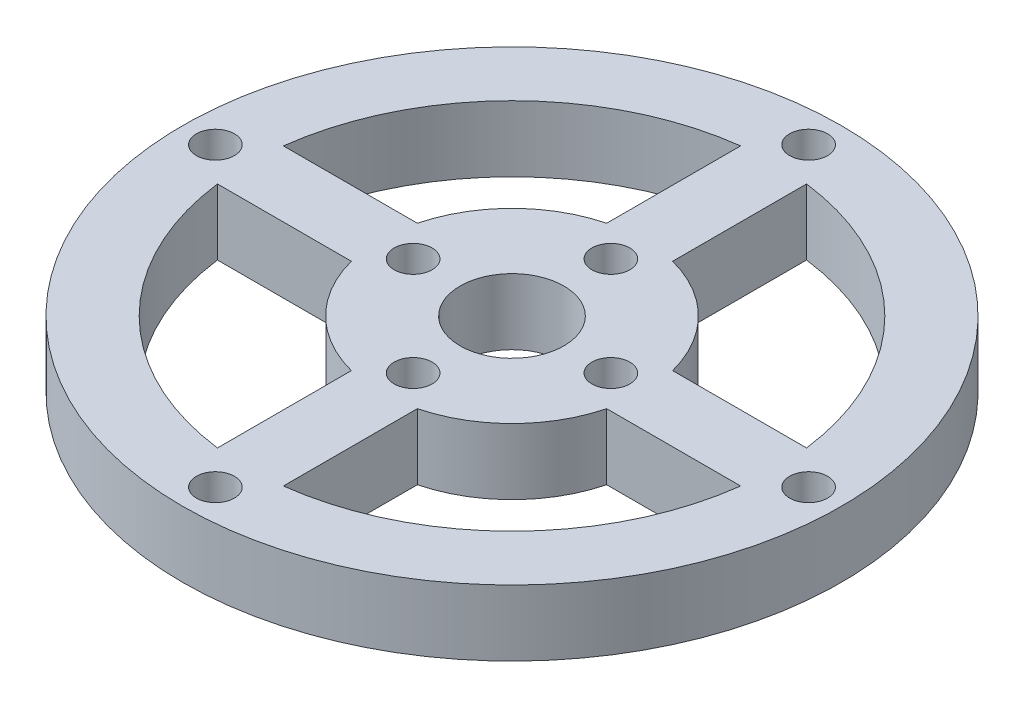
ISO-10303-21;
HEADER;
FILE_DESCRIPTION(('STEP AP214'),'2;1');
FILE_NAME('part.step','',(''),(''),'','','');
FILE_SCHEMA(('AUTOMOTIVE_DESIGN { 1 0 10303 214 1 1 1 1 }'));
ENDSEC;
DATA;
#1=APPLICATION_CONTEXT('core data for automotive mechanical design processes');
#2=APPLICATION_PROTOCOL_DEFINITION('international standard','automotive_design',2000,#1);
#3=PRODUCT_CONTEXT('',#1,'mechanical');
#4=PRODUCT('Part','Part','',(#3));
#5=PRODUCT_RELATED_PRODUCT_CATEGORY('part','',(#4));
#6=PRODUCT_DEFINITION_FORMATION('','',#4);
#7=PRODUCT_DEFINITION_CONTEXT('part definition',#1,'design');
#8=PRODUCT_DEFINITION('design','',#6,#7);
#9=PRODUCT_DEFINITION_SHAPE('','',#8);
#10=(LENGTH_UNIT() NAMED_UNIT(*) SI_UNIT(.MILLI.,.METRE.));
#11=(NAMED_UNIT(*) PLANE_ANGLE_UNIT() SI_UNIT($,.RADIAN.));
#12=(NAMED_UNIT(*) SI_UNIT($,.STERADIAN.) SOLID_ANGLE_UNIT());
#13=UNCERTAINTY_MEASURE_WITH_UNIT(LENGTH_MEASURE(1.E-05),#10,'distance_accuracy_value','');
#14=(GEOMETRIC_REPRESENTATION_CONTEXT(3) GLOBAL_UNCERTAINTY_ASSIGNED_CONTEXT((#13)) GLOBAL_UNIT_ASSIGNED_CONTEXT((#10,
#11,#12)) REPRESENTATION_CONTEXT('',''));
#15=CARTESIAN_POINT('',(0.,0.,0.));
#16=DIRECTION('',(0.,0.,1.));
#17=DIRECTION('',(1.,0.,0.));
#18=AXIS2_PLACEMENT_3D('',#15,#16,#17);
#19=CARTESIAN_POINT('',(0.,6.35,0.));
#20=DIRECTION('',(0.,-1.,0.));
#21=DIRECTION('',(0.,0.,-1.));
#22=AXIS2_PLACEMENT_3D('',#19,#20,#21);
#23=CYLINDRICAL_SURFACE('',#22,25.4);
#24=CARTESIAN_POINT('',(0.,0.,0.));
#25=DIRECTION('',(0.,1.,0.));
#26=DIRECTION('',(0.,0.,1.));
#27=AXIS2_PLACEMENT_3D('',#24,#25,#26);
#28=CIRCLE('',#27,25.4);
#29=CARTESIAN_POINT('',(3.175,0.,25.2007812378902));
#30=VERTEX_POINT('',#29);
#31=CARTESIAN_POINT('',(25.2007812378902,0.,3.17499999999996));
#32=VERTEX_POINT('',#31);
#33=EDGE_CURVE('E300',#30,#32,#28,.T.);
#34=ORIENTED_EDGE('',*,*,#33,.F.);
#35=DIRECTION('',(0.,-1.,0.));
#36=VECTOR('',#35,1.);
#37=CARTESIAN_POINT('',(3.175,6.35,25.2007812378902));
#38=LINE('',#37,#36);
#39=CARTESIAN_POINT('',(3.175,6.35,25.2007812378902));
#40=VERTEX_POINT('',#39);
#41=EDGE_CURVE('E11',#40,#30,#38,.T.);
#42=ORIENTED_EDGE('',*,*,#41,.F.);
#43=CARTESIAN_POINT('',(0.,6.35,0.));
#44=DIRECTION('',(0.,1.,0.));
#45=DIRECTION('',(0.,0.,1.));
#46=AXIS2_PLACEMENT_3D('',#43,#44,#45);
#47=CIRCLE('',#46,25.4);
#48=CARTESIAN_POINT('',(25.2007812378902,6.35,3.17499999999996));
#49=VERTEX_POINT('',#48);
#50=EDGE_CURVE('E175',#40,#49,#47,.T.);
#51=ORIENTED_EDGE('',*,*,#50,.T.);
#52=DIRECTION('',(0.,-1.,0.));
#53=VECTOR('',#52,1.);
#54=CARTESIAN_POINT('',(25.2007812378902,6.35,3.17499999999996));
#55=LINE('',#54,#53);
#56=EDGE_CURVE('E58',#49,#32,#55,.T.);
#57=ORIENTED_EDGE('',*,*,#56,.T.);
#58=EDGE_LOOP('',(#34,#42,#51,#57));
#59=FACE_BOUND('',#58,.T.);
#60=ADVANCED_FACE('F39',(#59),#23,.F.);
#61=CARTESIAN_POINT('',(3.17499999999997,6.35,0.));
#62=DIRECTION('',(-1.,0.,0.));
#63=DIRECTION('',(0.,0.,1.));
#64=AXIS2_PLACEMENT_3D('',#61,#62,#63);
#65=PLANE('',#64);
#66=DIRECTION('',(0.,0.,-1.));
#67=VECTOR('',#66,1.);
#68=CARTESIAN_POINT('',(3.17499999999997,0.,0.));
#69=LINE('',#68,#67);
#70=CARTESIAN_POINT('',(3.17499999999998,0.,12.2967221242086));
#71=VERTEX_POINT('',#70);
#72=EDGE_CURVE('E180',#30,#71,#69,.T.);
#73=ORIENTED_EDGE('',*,*,#72,.T.);
#74=DIRECTION('',(0.,-1.,0.));
#75=VECTOR('',#74,1.);
#76=CARTESIAN_POINT('',(3.17499999999998,6.35,12.2967221242086));
#77=LINE('',#76,#75);
#78=CARTESIAN_POINT('',(3.17499999999998,6.35,12.2967221242086));
#79=VERTEX_POINT('',#78);
#80=EDGE_CURVE('E49',#79,#71,#77,.T.);
#81=ORIENTED_EDGE('',*,*,#80,.F.);
#82=DIRECTION('',(0.,0.,-1.));
#83=VECTOR('',#82,1.);
#84=CARTESIAN_POINT('',(3.17499999999997,6.35,0.));
#85=LINE('',#84,#83);
#86=EDGE_CURVE('E168',#40,#79,#85,.T.);
#87=ORIENTED_EDGE('',*,*,#86,.F.);
#88=ORIENTED_EDGE('',*,*,#41,.T.);
#89=EDGE_LOOP('',(#73,#81,#87,#88));
#90=FACE_BOUND('',#89,.T.);
#91=ADVANCED_FACE('F178',(#90),#65,.F.);
#92=CARTESIAN_POINT('',(0.,6.35,0.));
#93=DIRECTION('',(0.,-1.,0.));
#94=DIRECTION('',(0.,0.,-1.));
#95=AXIS2_PLACEMENT_3D('',#92,#93,#94);
#96=CYLINDRICAL_SURFACE('',#95,12.7);
#97=CARTESIAN_POINT('',(0.,0.,0.));
#98=DIRECTION('',(0.,1.,0.));
#99=DIRECTION('',(0.,0.,1.));
#100=AXIS2_PLACEMENT_3D('',#97,#98,#99);
#101=CIRCLE('',#100,12.7);
#102=CARTESIAN_POINT('',(12.2967221242086,0.,3.17499999999997));
#103=VERTEX_POINT('',#102);
#104=EDGE_CURVE('E292',#71,#103,#101,.T.);
#105=ORIENTED_EDGE('',*,*,#104,.T.);
#106=DIRECTION('',(0.,-1.,0.));
#107=VECTOR('',#106,1.);
#108=CARTESIAN_POINT('',(12.2967221242086,6.35,3.17499999999997));
#109=LINE('',#108,#107);
#110=CARTESIAN_POINT('',(12.2967221242086,6.35,3.17499999999997));
#111=VERTEX_POINT('',#110);
#112=EDGE_CURVE('E108',#111,#103,#109,.T.);
#113=ORIENTED_EDGE('',*,*,#112,.F.);
#114=CARTESIAN_POINT('',(0.,6.35,0.));
#115=DIRECTION('',(0.,1.,0.));
#116=DIRECTION('',(0.,0.,1.));
#117=AXIS2_PLACEMENT_3D('',#114,#115,#116);
#118=CIRCLE('',#117,12.7);
#119=EDGE_CURVE('E160',#79,#111,#118,.T.);
#120=ORIENTED_EDGE('',*,*,#119,.F.);
#121=ORIENTED_EDGE('',*,*,#80,.T.);
#122=EDGE_LOOP('',(#105,#113,#120,#121));
#123=FACE_BOUND('',#122,.T.);
#124=ADVANCED_FACE('F162',(#123),#96,.T.);
#125=CARTESIAN_POINT('',(0.,6.35,-3.17499999999996));
#126=DIRECTION('',(0.,0.,1.));
#127=DIRECTION('',(1.,0.,0.));
#128=AXIS2_PLACEMENT_3D('',#125,#126,#127);
#129=PLANE('',#128);
#130=DIRECTION('',(-1.,0.,0.));
#131=VECTOR('',#130,1.);
#132=CARTESIAN_POINT('',(0.,0.,-3.17499999999996));
#133=LINE('',#132,#131);
#134=CARTESIAN_POINT('',(25.2007812378902,0.,-3.17499999999996));
#135=VERTEX_POINT('',#134);
#136=CARTESIAN_POINT('',(12.2967221242086,0.,-3.17499999999996));
#137=VERTEX_POINT('',#136);
#138=EDGE_CURVE('E307',#135,#137,#133,.T.);
#139=ORIENTED_EDGE('',*,*,#138,.T.);
#140=DIRECTION('',(0.,-1.,0.));
#141=VECTOR('',#140,1.);
#142=CARTESIAN_POINT('',(12.2967221242086,6.35,-3.17499999999996));
#143=LINE('',#142,#141);
#144=CARTESIAN_POINT('',(12.2967221242086,6.35,-3.17499999999996));
#145=VERTEX_POINT('',#144);
#146=EDGE_CURVE('E193',#145,#137,#143,.T.);
#147=ORIENTED_EDGE('',*,*,#146,.F.);
#148=DIRECTION('',(-1.,0.,0.));
#149=VECTOR('',#148,1.);
#150=CARTESIAN_POINT('',(0.,6.35,-3.17499999999996));
#151=LINE('',#150,#149);
#152=CARTESIAN_POINT('',(25.2007812378902,6.35,-3.17499999999996));
#153=VERTEX_POINT('',#152);
#154=EDGE_CURVE('E274',#153,#145,#151,.T.);
#155=ORIENTED_EDGE('',*,*,#154,.F.);
#156=DIRECTION('',(0.,-1.,0.));
#157=VECTOR('',#156,1.);
#158=CARTESIAN_POINT('',(25.2007812378902,6.35,-3.17499999999996));
#159=LINE('',#158,#157);
#160=EDGE_CURVE('E185',#153,#135,#159,.T.);
#161=ORIENTED_EDGE('',*,*,#160,.T.);
#162=EDGE_LOOP('',(#139,#147,#155,#161));
#163=FACE_BOUND('',#162,.T.);
#164=ADVANCED_FACE('F396',(#163),#129,.F.);
#165=CARTESIAN_POINT('',(3.17499999999998,0.,-12.2967221242086));
#166=VERTEX_POINT('',#165);
#167=EDGE_CURVE('E310',#137,#166,#101,.T.);
#168=ORIENTED_EDGE('',*,*,#167,.T.);
#169=DIRECTION('',(0.,-1.,0.));
#170=VECTOR('',#169,1.);
#171=CARTESIAN_POINT('',(3.17499999999998,6.35,-12.2967221242086));
#172=LINE('',#171,#170);
#173=CARTESIAN_POINT('',(3.17499999999998,6.35,-12.2967221242086));
#174=VERTEX_POINT('',#173);
#175=EDGE_CURVE('E190',#174,#166,#172,.T.);
#176=ORIENTED_EDGE('',*,*,#175,.F.);
#177=EDGE_CURVE('E170',#145,#174,#118,.T.);
#178=ORIENTED_EDGE('',*,*,#177,.F.);
#179=ORIENTED_EDGE('',*,*,#146,.T.);
#180=EDGE_LOOP('',(#168,#176,#178,#179));
#181=FACE_BOUND('',#180,.T.);
#182=ADVANCED_FACE('F394',(#181),#96,.T.);
#183=CARTESIAN_POINT('',(3.17499999999997,6.35,0.));
#184=DIRECTION('',(-1.,0.,0.));
#185=DIRECTION('',(0.,0.,1.));
#186=AXIS2_PLACEMENT_3D('',#183,#184,#185);
#187=PLANE('',#186);
#188=DIRECTION('',(0.,0.,-1.));
#189=VECTOR('',#188,1.);
#190=CARTESIAN_POINT('',(3.17499999999997,0.,0.));
#191=LINE('',#190,#189);
#192=CARTESIAN_POINT('',(3.175,0.,-25.2007812378902));
#193=VERTEX_POINT('',#192);
#194=EDGE_CURVE('E311',#166,#193,#191,.T.);
#195=ORIENTED_EDGE('',*,*,#194,.T.);
#196=DIRECTION('',(0.,-1.,0.));
#197=VECTOR('',#196,1.);
#198=CARTESIAN_POINT('',(3.175,6.35,-25.2007812378902));
#199=LINE('',#198,#197);
#200=CARTESIAN_POINT('',(3.175,6.35,-25.2007812378902));
#201=VERTEX_POINT('',#200);
#202=EDGE_CURVE('E187',#201,#193,#199,.T.);
#203=ORIENTED_EDGE('',*,*,#202,.F.);
#204=DIRECTION('',(0.,0.,-1.));
#205=VECTOR('',#204,1.);
#206=CARTESIAN_POINT('',(3.17499999999997,6.35,0.));
#207=LINE('',#206,#205);
#208=EDGE_CURVE('E277',#174,#201,#207,.T.);
#209=ORIENTED_EDGE('',*,*,#208,.F.);
#210=ORIENTED_EDGE('',*,*,#175,.T.);
#211=EDGE_LOOP('',(#195,#203,#209,#210));
#212=FACE_BOUND('',#211,.T.);
#213=ADVANCED_FACE('F393',(#212),#187,.F.);
#214=CARTESIAN_POINT('',(-3.17500000000003,6.35,0.));
#215=DIRECTION('',(-1.,0.,0.));
#216=DIRECTION('',(0.,0.,1.));
#217=AXIS2_PLACEMENT_3D('',#214,#215,#216);
#218=PLANE('',#217);
#219=DIRECTION('',(0.,0.,-1.));
#220=VECTOR('',#219,1.);
#221=CARTESIAN_POINT('',(-3.17500000000003,0.,0.));
#222=LINE('',#221,#220);
#223=CARTESIAN_POINT('',(-3.17500000000002,0.,-12.2967221242085));
#224=VERTEX_POINT('',#223);
#225=CARTESIAN_POINT('',(-3.175,0.,-25.2007812378902));
#226=VERTEX_POINT('',#225);
#227=EDGE_CURVE('E299',#224,#226,#222,.T.);
#228=ORIENTED_EDGE('',*,*,#227,.F.);
#229=DIRECTION('',(0.,-1.,0.));
#230=VECTOR('',#229,1.);
#231=CARTESIAN_POINT('',(-3.17500000000002,6.35,-12.2967221242085));
#232=LINE('',#231,#230);
#233=CARTESIAN_POINT('',(-3.17500000000002,6.35,-12.2967221242085));
#234=VERTEX_POINT('',#233);
#235=EDGE_CURVE('E188',#234,#224,#232,.T.);
#236=ORIENTED_EDGE('',*,*,#235,.F.);
#237=DIRECTION('',(0.,0.,-1.));
#238=VECTOR('',#237,1.);
#239=CARTESIAN_POINT('',(-3.17500000000003,6.35,0.));
#240=LINE('',#239,#238);
#241=CARTESIAN_POINT('',(-3.175,6.35,-25.2007812378902));
#242=VERTEX_POINT('',#241);
#243=EDGE_CURVE('E267',#234,#242,#240,.T.);
#244=ORIENTED_EDGE('',*,*,#243,.T.);
#245=DIRECTION('',(0.,-1.,0.));
#246=VECTOR('',#245,1.);
#247=CARTESIAN_POINT('',(-3.175,6.35,-25.2007812378902));
#248=LINE('',#247,#246);
#249=EDGE_CURVE('E196',#242,#226,#248,.T.);
#250=ORIENTED_EDGE('',*,*,#249,.T.);
#251=EDGE_LOOP('',(#228,#236,#244,#250));
#252=FACE_BOUND('',#251,.T.);
#253=ADVANCED_FACE('F408',(#252),#218,.T.);
#254=CARTESIAN_POINT('',(-12.2967221242086,0.,-3.17499999999996));
#255=VERTEX_POINT('',#254);
#256=EDGE_CURVE('E293',#224,#255,#101,.T.);
#257=ORIENTED_EDGE('',*,*,#256,.T.);
#258=DIRECTION('',(0.,-1.,0.));
#259=VECTOR('',#258,1.);
#260=CARTESIAN_POINT('',(-12.2967221242086,6.35,-3.17499999999996));
#261=LINE('',#260,#259);
#262=CARTESIAN_POINT('',(-12.2967221242086,6.35,-3.17499999999996));
#263=VERTEX_POINT('',#262);
#264=EDGE_CURVE('E201',#263,#255,#261,.T.);
#265=ORIENTED_EDGE('',*,*,#264,.F.);
#266=EDGE_CURVE('E261',#234,#263,#118,.T.);
#267=ORIENTED_EDGE('',*,*,#266,.F.);
#268=ORIENTED_EDGE('',*,*,#235,.T.);
#269=EDGE_LOOP('',(#257,#265,#267,#268));
#270=FACE_BOUND('',#269,.T.);
#271=ADVANCED_FACE('F383',(#270),#96,.T.);
#272=CARTESIAN_POINT('',(0.,6.35,-3.17499999999996));
#273=DIRECTION('',(0.,0.,-1.));
#274=DIRECTION('',(-1.,0.,0.));
#275=AXIS2_PLACEMENT_3D('',#272,#273,#274);
#276=PLANE('',#275);
#277=DIRECTION('',(1.,0.,0.));
#278=VECTOR('',#277,1.);
#279=CARTESIAN_POINT('',(0.,0.,-3.17499999999996));
#280=LINE('',#279,#278);
#281=CARTESIAN_POINT('',(-25.2007812378902,0.,-3.17499999999996));
#282=VERTEX_POINT('',#281);
#283=EDGE_CURVE('E304',#282,#255,#280,.T.);
#284=ORIENTED_EDGE('',*,*,#283,.F.);
#285=DIRECTION('',(0.,-1.,0.));
#286=VECTOR('',#285,1.);
#287=CARTESIAN_POINT('',(-25.2007812378902,6.35,-3.17499999999996));
#288=LINE('',#287,#286);
#289=CARTESIAN_POINT('',(-25.2007812378902,6.35,-3.17499999999996));
#290=VERTEX_POINT('',#289);
#291=EDGE_CURVE('E198',#290,#282,#288,.T.);
#292=ORIENTED_EDGE('',*,*,#291,.F.);
#293=DIRECTION('',(1.,0.,0.));
#294=VECTOR('',#293,1.);
#295=CARTESIAN_POINT('',(0.,6.35,-3.17499999999996));
#296=LINE('',#295,#294);
#297=EDGE_CURVE('E271',#290,#263,#296,.T.);
#298=ORIENTED_EDGE('',*,*,#297,.T.);
#299=ORIENTED_EDGE('',*,*,#264,.T.);
#300=EDGE_LOOP('',(#284,#292,#298,#299));
#301=FACE_BOUND('',#300,.T.);
#302=ADVANCED_FACE('F378',(#301),#276,.T.);
#303=CARTESIAN_POINT('',(0.,6.35,3.17499999999996));
#304=DIRECTION('',(0.,0.,-1.));
#305=DIRECTION('',(-1.,0.,0.));
#306=AXIS2_PLACEMENT_3D('',#303,#304,#305);
#307=PLANE('',#306);
#308=DIRECTION('',(1.,0.,0.));
#309=VECTOR('',#308,1.);
#310=CARTESIAN_POINT('',(0.,0.,3.17499999999996));
#311=LINE('',#310,#309);
#312=CARTESIAN_POINT('',(-25.2007812378902,0.,3.17499999999996));
#313=VERTEX_POINT('',#312);
#314=CARTESIAN_POINT('',(-12.2967221242086,0.,3.17499999999996));
#315=VERTEX_POINT('',#314);
#316=EDGE_CURVE('E256',#313,#315,#311,.T.);
#317=ORIENTED_EDGE('',*,*,#316,.T.);
#318=DIRECTION('',(0.,-1.,0.));
#319=VECTOR('',#318,1.);
#320=CARTESIAN_POINT('',(-12.2967221242086,6.35,3.17499999999996));
#321=LINE('',#320,#319);
#322=CARTESIAN_POINT('',(-12.2967221242086,6.35,3.17499999999996));
#323=VERTEX_POINT('',#322);
#324=EDGE_CURVE('E199',#323,#315,#321,.T.);
#325=ORIENTED_EDGE('',*,*,#324,.F.);
#326=DIRECTION('',(1.,0.,0.));
#327=VECTOR('',#326,1.);
#328=CARTESIAN_POINT('',(0.,6.35,3.17499999999996));
#329=LINE('',#328,#327);
#330=CARTESIAN_POINT('',(-25.2007812378902,6.35,3.17499999999996));
#331=VERTEX_POINT('',#330);
#332=EDGE_CURVE('E257',#331,#323,#329,.T.);
#333=ORIENTED_EDGE('',*,*,#332,.F.);
#334=DIRECTION('',(0.,-1.,0.));
#335=VECTOR('',#334,1.);
#336=CARTESIAN_POINT('',(-25.2007812378902,6.35,3.17499999999996));
#337=LINE('',#336,#335);
#338=EDGE_CURVE('E204',#331,#313,#337,.T.);
#339=ORIENTED_EDGE('',*,*,#338,.T.);
#340=EDGE_LOOP('',(#317,#325,#333,#339));
#341=FACE_BOUND('',#340,.T.);
#342=ADVANCED_FACE('F41',(#341),#307,.F.);
#343=CARTESIAN_POINT('',(-3.17499999999997,0.,12.2967221242086));
#344=VERTEX_POINT('',#343);
#345=EDGE_CURVE('E288',#315,#344,#101,.T.);
#346=ORIENTED_EDGE('',*,*,#345,.T.);
#347=DIRECTION('',(0.,-1.,0.));
#348=VECTOR('',#347,1.);
#349=CARTESIAN_POINT('',(-3.17499999999997,6.35,12.2967221242086));
#350=LINE('',#349,#348);
#351=CARTESIAN_POINT('',(-3.17499999999997,6.35,12.2967221242086));
#352=VERTEX_POINT('',#351);
#353=EDGE_CURVE('E209',#352,#344,#350,.T.);
#354=ORIENTED_EDGE('',*,*,#353,.F.);
#355=EDGE_CURVE('E121',#323,#352,#118,.T.);
#356=ORIENTED_EDGE('',*,*,#355,.F.);
#357=ORIENTED_EDGE('',*,*,#324,.T.);
#358=EDGE_LOOP('',(#346,#354,#356,#357));
#359=FACE_BOUND('',#358,.T.);
#360=ADVANCED_FACE('F404',(#359),#96,.T.);
#361=CARTESIAN_POINT('',(-3.17499999999997,6.35,0.));
#362=DIRECTION('',(-1.,0.,0.));
#363=DIRECTION('',(0.,0.,1.));
#364=AXIS2_PLACEMENT_3D('',#361,#362,#363);
#365=PLANE('',#364);
#366=DIRECTION('',(0.,0.,-1.));
#367=VECTOR('',#366,1.);
#368=CARTESIAN_POINT('',(-3.17499999999997,0.,0.));
#369=LINE('',#368,#367);
#370=CARTESIAN_POINT('',(-3.17499999999997,0.,25.2007812378902));
#371=VERTEX_POINT('',#370);
#372=EDGE_CURVE('E291',#371,#344,#369,.T.);
#373=ORIENTED_EDGE('',*,*,#372,.F.);
#374=DIRECTION('',(0.,-1.,0.));
#375=VECTOR('',#374,1.);
#376=CARTESIAN_POINT('',(-3.17499999999997,6.35,25.2007812378902));
#377=LINE('',#376,#375);
#378=CARTESIAN_POINT('',(-3.17499999999997,6.35,25.2007812378902));
#379=VERTEX_POINT('',#378);
#380=EDGE_CURVE('E206',#379,#371,#377,.T.);
#381=ORIENTED_EDGE('',*,*,#380,.F.);
#382=DIRECTION('',(0.,0.,-1.));
#383=VECTOR('',#382,1.);
#384=CARTESIAN_POINT('',(-3.17499999999997,6.35,0.));
#385=LINE('',#384,#383);
#386=EDGE_CURVE('E260',#379,#352,#385,.T.);
#387=ORIENTED_EDGE('',*,*,#386,.T.);
#388=ORIENTED_EDGE('',*,*,#353,.T.);
#389=EDGE_LOOP('',(#373,#381,#387,#388));
#390=FACE_BOUND('',#389,.T.);
#391=ADVANCED_FACE('F411',(#390),#365,.T.);
#392=CARTESIAN_POINT('',(0.,6.35,0.));
#393=DIRECTION('',(0.,-1.,0.));
#394=DIRECTION('',(0.,0.,-1.));
#395=AXIS2_PLACEMENT_3D('',#392,#393,#394);
#396=CYLINDRICAL_SURFACE('',#395,31.75);
#397=CARTESIAN_POINT('',(0.,6.35,0.));
#398=DIRECTION('',(0.,1.,0.));
#399=DIRECTION('',(0.,0.,1.));
#400=AXIS2_PLACEMENT_3D('',#397,#398,#399);
#401=CIRCLE('',#400,31.75);
#402=CARTESIAN_POINT('',(0.,6.35,31.75));
#403=VERTEX_POINT('',#402);
#404=EDGE_CURVE('E281',#403,#403,#401,.T.);
#405=ORIENTED_EDGE('',*,*,#404,.F.);
#406=EDGE_LOOP('',(#405));
#407=FACE_BOUND('',#406,.T.);
#408=CARTESIAN_POINT('',(0.,0.,0.));
#409=DIRECTION('',(0.,1.,0.));
#410=DIRECTION('',(0.,0.,1.));
#411=AXIS2_PLACEMENT_3D('',#408,#409,#410);
#412=CIRCLE('',#411,31.75);
#413=CARTESIAN_POINT('',(0.,0.,31.75));
#414=VERTEX_POINT('',#413);
#415=EDGE_CURVE('E319',#414,#414,#412,.T.);
#416=ORIENTED_EDGE('',*,*,#415,.T.);
#417=EDGE_LOOP('',(#416));
#418=FACE_BOUND('',#417,.T.);
#419=ADVANCED_FACE('F358',(#407,#418),#396,.T.);
#420=CARTESIAN_POINT('',(0.,6.35,3.17499999999999));
#421=DIRECTION('',(0.,0.,1.));
#422=DIRECTION('',(1.,0.,0.));
#423=AXIS2_PLACEMENT_3D('',#420,#421,#422);
#424=PLANE('',#423);
#425=DIRECTION('',(-1.,0.,0.));
#426=VECTOR('',#425,1.);
#427=CARTESIAN_POINT('',(0.,0.,3.17499999999999));
#428=LINE('',#427,#426);
#429=EDGE_CURVE('E316',#32,#103,#428,.T.);
#430=ORIENTED_EDGE('',*,*,#429,.F.);
#431=ORIENTED_EDGE('',*,*,#56,.F.);
#432=DIRECTION('',(-1.,0.,0.));
#433=VECTOR('',#432,1.);
#434=CARTESIAN_POINT('',(0.,6.35,3.17499999999999));
#435=LINE('',#434,#433);
#436=EDGE_CURVE('E167',#49,#111,#435,.T.);
#437=ORIENTED_EDGE('',*,*,#436,.T.);
#438=ORIENTED_EDGE('',*,*,#112,.T.);
#439=EDGE_LOOP('',(#430,#431,#437,#438));
#440=FACE_BOUND('',#439,.T.);
#441=ADVANCED_FACE('F351',(#440),#424,.T.);
#442=EDGE_CURVE('E314',#135,#193,#28,.T.);
#443=ORIENTED_EDGE('',*,*,#442,.F.);
#444=ORIENTED_EDGE('',*,*,#160,.F.);
#445=EDGE_CURVE('E278',#153,#201,#47,.T.);
#446=ORIENTED_EDGE('',*,*,#445,.T.);
#447=ORIENTED_EDGE('',*,*,#202,.T.);
#448=EDGE_LOOP('',(#443,#444,#446,#447));
#449=FACE_BOUND('',#448,.T.);
#450=ADVANCED_FACE('F344',(#449),#23,.F.);
#451=EDGE_CURVE('E301',#226,#282,#28,.T.);
#452=ORIENTED_EDGE('',*,*,#451,.F.);
#453=ORIENTED_EDGE('',*,*,#249,.F.);
#454=EDGE_CURVE('E268',#242,#290,#47,.T.);
#455=ORIENTED_EDGE('',*,*,#454,.T.);
#456=ORIENTED_EDGE('',*,*,#291,.T.);
#457=EDGE_LOOP('',(#452,#453,#455,#456));
#458=FACE_BOUND('',#457,.T.);
#459=ADVANCED_FACE('F338',(#458),#23,.F.);
#460=EDGE_CURVE('E296',#313,#371,#28,.T.);
#461=ORIENTED_EDGE('',*,*,#460,.F.);
#462=ORIENTED_EDGE('',*,*,#338,.F.);
#463=EDGE_CURVE('E264',#331,#379,#47,.T.);
#464=ORIENTED_EDGE('',*,*,#463,.T.);
#465=ORIENTED_EDGE('',*,*,#380,.T.);
#466=EDGE_LOOP('',(#461,#462,#464,#465));
#467=FACE_BOUND('',#466,.T.);
#468=ADVANCED_FACE('F329',(#467),#23,.F.);
#469=CARTESIAN_POINT('',(0.,6.35,0.));
#470=DIRECTION('',(0.,-1.,0.));
#471=DIRECTION('',(0.,0.,-1.));
#472=AXIS2_PLACEMENT_3D('',#469,#470,#471);
#473=CYLINDRICAL_SURFACE('',#472,5.);
#474=CARTESIAN_POINT('',(0.,6.35,0.));
#475=DIRECTION('',(0.,1.,0.));
#476=DIRECTION('',(0.,0.,1.));
#477=AXIS2_PLACEMENT_3D('',#474,#475,#476);
#478=CIRCLE('',#477,5.);
#479=CARTESIAN_POINT('',(0.,6.35,5.));
#480=VERTEX_POINT('',#479);
#481=EDGE_CURVE('E207',#480,#480,#478,.T.);
#482=ORIENTED_EDGE('',*,*,#481,.T.);
#483=EDGE_LOOP('',(#482));
#484=FACE_BOUND('',#483,.T.);
#485=CARTESIAN_POINT('',(0.,0.,0.));
#486=DIRECTION('',(0.,1.,0.));
#487=DIRECTION('',(0.,0.,1.));
#488=AXIS2_PLACEMENT_3D('',#485,#486,#487);
#489=CIRCLE('',#488,5.);
#490=CARTESIAN_POINT('',(0.,0.,5.));
#491=VERTEX_POINT('',#490);
#492=EDGE_CURVE('E258',#491,#491,#489,.T.);
#493=ORIENTED_EDGE('',*,*,#492,.F.);
#494=EDGE_LOOP('',(#493));
#495=FACE_BOUND('',#494,.T.);
#496=ADVANCED_FACE('F327',(#484,#495),#473,.F.);
#497=CARTESIAN_POINT('',(0.,6.35,0.));
#498=DIRECTION('',(0.,1.,0.));
#499=DIRECTION('',(0.,0.,1.));
#500=AXIS2_PLACEMENT_3D('',#497,#498,#499);
#501=PLANE('',#500);
#502=CARTESIAN_POINT('',(9.525,6.35,0.));
#503=DIRECTION('',(0.,1.,0.));
#504=DIRECTION('',(0.,0.,1.));
#505=AXIS2_PLACEMENT_3D('',#502,#503,#504);
#506=CIRCLE('',#505,1.8288);
#507=CARTESIAN_POINT('',(9.525,6.35,1.8288000000001));
#508=VERTEX_POINT('',#507);
#509=EDGE_CURVE('E713',#508,#508,#506,.T.);
#510=ORIENTED_EDGE('',*,*,#509,.F.);
#511=EDGE_LOOP('',(#510));
#512=FACE_BOUND('',#511,.T.);
#513=CARTESIAN_POINT('',(28.575,6.35,2.99307237772328E-13));
#514=DIRECTION('',(0.,1.,0.));
#515=DIRECTION('',(0.,0.,1.));
#516=AXIS2_PLACEMENT_3D('',#513,#514,#515);
#517=CIRCLE('',#516,1.8288);
#518=CARTESIAN_POINT('',(28.575,6.35,1.8288000000003));
#519=VERTEX_POINT('',#518);
#520=EDGE_CURVE('E231',#519,#519,#517,.T.);
#521=ORIENTED_EDGE('',*,*,#520,.F.);
#522=EDGE_LOOP('',(#521));
#523=FACE_BOUND('',#522,.T.);
#524=CARTESIAN_POINT('',(0.,6.35,-9.525));
#525=DIRECTION('',(0.,1.,0.));
#526=DIRECTION('',(0.,0.,1.));
#527=AXIS2_PLACEMENT_3D('',#524,#525,#526);
#528=CIRCLE('',#527,1.8288);
#529=CARTESIAN_POINT('',(0.,6.35,-7.6962));
#530=VERTEX_POINT('',#529);
#531=EDGE_CURVE('E219',#530,#530,#528,.T.);
#532=ORIENTED_EDGE('',*,*,#531,.F.);
#533=EDGE_LOOP('',(#532));
#534=FACE_BOUND('',#533,.T.);
#535=CARTESIAN_POINT('',(0.,6.35,-28.575));
#536=DIRECTION('',(0.,1.,0.));
#537=DIRECTION('',(0.,0.,1.));
#538=AXIS2_PLACEMENT_3D('',#535,#536,#537);
#539=CIRCLE('',#538,1.8288);
#540=CARTESIAN_POINT('',(0.,6.35,-26.7462));
#541=VERTEX_POINT('',#540);
#542=EDGE_CURVE('E218',#541,#541,#539,.T.);
#543=ORIENTED_EDGE('',*,*,#542,.F.);
#544=EDGE_LOOP('',(#543));
#545=FACE_BOUND('',#544,.T.);
#546=CARTESIAN_POINT('',(-9.525,6.35,0.));
#547=DIRECTION('',(0.,1.,0.));
#548=DIRECTION('',(0.,0.,1.));
#549=AXIS2_PLACEMENT_3D('',#546,#547,#548);
#550=CIRCLE('',#549,1.8288);
#551=CARTESIAN_POINT('',(-9.525,6.35,1.82879999999997));
#552=VERTEX_POINT('',#551);
#553=EDGE_CURVE('E215',#552,#552,#550,.T.);
#554=ORIENTED_EDGE('',*,*,#553,.F.);
#555=EDGE_LOOP('',(#554));
#556=FACE_BOUND('',#555,.T.);
#557=CARTESIAN_POINT('',(-28.575,6.35,0.));
#558=DIRECTION('',(0.,1.,0.));
#559=DIRECTION('',(0.,0.,1.));
#560=AXIS2_PLACEMENT_3D('',#557,#558,#559);
#561=CIRCLE('',#560,1.8288);
#562=CARTESIAN_POINT('',(-28.575,6.35,1.8287999999999));
#563=VERTEX_POINT('',#562);
#564=EDGE_CURVE('E214',#563,#563,#561,.T.);
#565=ORIENTED_EDGE('',*,*,#564,.F.);
#566=EDGE_LOOP('',(#565));
#567=FACE_BOUND('',#566,.T.);
#568=CARTESIAN_POINT('',(0.,6.35,9.525));
#569=DIRECTION('',(0.,1.,0.));
#570=DIRECTION('',(0.,0.,1.));
#571=AXIS2_PLACEMENT_3D('',#568,#569,#570);
#572=CIRCLE('',#571,1.8288);
#573=CARTESIAN_POINT('',(0.,6.35,11.3538));
#574=VERTEX_POINT('',#573);
#575=EDGE_CURVE('E244',#574,#574,#572,.T.);
#576=ORIENTED_EDGE('',*,*,#575,.F.);
#577=EDGE_LOOP('',(#576));
#578=FACE_BOUND('',#577,.T.);
#579=CARTESIAN_POINT('',(0.,6.35,28.575));
#580=DIRECTION('',(0.,1.,0.));
#581=DIRECTION('',(0.,0.,1.));
#582=AXIS2_PLACEMENT_3D('',#579,#580,#581);
#583=CIRCLE('',#582,1.8288);
#584=CARTESIAN_POINT('',(0.,6.35,30.4038));
#585=VERTEX_POINT('',#584);
#586=EDGE_CURVE('E250',#585,#585,#583,.T.);
#587=ORIENTED_EDGE('',*,*,#586,.F.);
#588=EDGE_LOOP('',(#587));
#589=FACE_BOUND('',#588,.T.);
#590=ORIENTED_EDGE('',*,*,#332,.T.);
#591=ORIENTED_EDGE('',*,*,#355,.T.);
#592=ORIENTED_EDGE('',*,*,#386,.F.);
#593=ORIENTED_EDGE('',*,*,#463,.F.);
#594=EDGE_LOOP('',(#590,#591,#592,#593));
#595=FACE_BOUND('',#594,.T.);
#596=ORIENTED_EDGE('',*,*,#243,.F.);
#597=ORIENTED_EDGE('',*,*,#266,.T.);
#598=ORIENTED_EDGE('',*,*,#297,.F.);
#599=ORIENTED_EDGE('',*,*,#454,.F.);
#600=EDGE_LOOP('',(#596,#597,#598,#599));
#601=FACE_BOUND('',#600,.T.);
#602=ORIENTED_EDGE('',*,*,#154,.T.);
#603=ORIENTED_EDGE('',*,*,#177,.T.);
#604=ORIENTED_EDGE('',*,*,#208,.T.);
#605=ORIENTED_EDGE('',*,*,#445,.F.);
#606=EDGE_LOOP('',(#602,#603,#604,#605));
#607=FACE_BOUND('',#606,.T.);
#608=ORIENTED_EDGE('',*,*,#50,.F.);
#609=ORIENTED_EDGE('',*,*,#86,.T.);
#610=ORIENTED_EDGE('',*,*,#119,.T.);
#611=ORIENTED_EDGE('',*,*,#436,.F.);
#612=EDGE_LOOP('',(#608,#609,#610,#611));
#613=FACE_BOUND('',#612,.T.);
#614=ORIENTED_EDGE('',*,*,#404,.T.);
#615=EDGE_LOOP('',(#614));
#616=FACE_BOUND('',#615,.T.);
#617=ORIENTED_EDGE('',*,*,#481,.F.);
#618=EDGE_LOOP('',(#617));
#619=FACE_BOUND('',#618,.T.);
#620=ADVANCED_FACE('F173',(#512,#523,#534,#545,#556,#567,#578,#589,#595,#601,#607,#613,#616,
#619),#501,.T.);
#621=CARTESIAN_POINT('',(0.,0.,0.));
#622=DIRECTION('',(0.,1.,0.));
#623=DIRECTION('',(0.,0.,1.));
#624=AXIS2_PLACEMENT_3D('',#621,#622,#623);
#625=PLANE('',#624);
#626=CARTESIAN_POINT('',(9.525,0.,0.));
#627=DIRECTION('',(0.,1.,0.));
#628=DIRECTION('',(0.,0.,1.));
#629=AXIS2_PLACEMENT_3D('',#626,#627,#628);
#630=CIRCLE('',#629,1.8288);
#631=CARTESIAN_POINT('',(9.525,0.,1.82880000000009));
#632=VERTEX_POINT('',#631);
#633=EDGE_CURVE('E43',#632,#632,#630,.T.);
#634=ORIENTED_EDGE('',*,*,#633,.T.);
#635=EDGE_LOOP('',(#634));
#636=FACE_BOUND('',#635,.T.);
#637=CARTESIAN_POINT('',(28.575,0.,2.99307237772328E-13));
#638=DIRECTION('',(0.,1.,0.));
#639=DIRECTION('',(0.,0.,1.));
#640=AXIS2_PLACEMENT_3D('',#637,#638,#639);
#641=CIRCLE('',#640,1.8288);
#642=CARTESIAN_POINT('',(28.575,0.,1.8288000000003));
#643=VERTEX_POINT('',#642);
#644=EDGE_CURVE('E226',#643,#643,#641,.T.);
#645=ORIENTED_EDGE('',*,*,#644,.T.);
#646=EDGE_LOOP('',(#645));
#647=FACE_BOUND('',#646,.T.);
#648=CARTESIAN_POINT('',(0.,0.,-9.525));
#649=DIRECTION('',(0.,1.,0.));
#650=DIRECTION('',(0.,0.,1.));
#651=AXIS2_PLACEMENT_3D('',#648,#649,#650);
#652=CIRCLE('',#651,1.8288);
#653=CARTESIAN_POINT('',(0.,0.,-7.6962));
#654=VERTEX_POINT('',#653);
#655=EDGE_CURVE('E216',#654,#654,#652,.T.);
#656=ORIENTED_EDGE('',*,*,#655,.T.);
#657=EDGE_LOOP('',(#656));
#658=FACE_BOUND('',#657,.T.);
#659=CARTESIAN_POINT('',(0.,0.,-28.575));
#660=DIRECTION('',(0.,1.,0.));
#661=DIRECTION('',(0.,0.,1.));
#662=AXIS2_PLACEMENT_3D('',#659,#660,#661);
#663=CIRCLE('',#662,1.8288);
#664=CARTESIAN_POINT('',(0.,0.,-26.7462));
#665=VERTEX_POINT('',#664);
#666=EDGE_CURVE('E223',#665,#665,#663,.T.);
#667=ORIENTED_EDGE('',*,*,#666,.T.);
#668=EDGE_LOOP('',(#667));
#669=FACE_BOUND('',#668,.T.);
#670=CARTESIAN_POINT('',(-9.525,0.,0.));
#671=DIRECTION('',(0.,1.,0.));
#672=DIRECTION('',(0.,0.,1.));
#673=AXIS2_PLACEMENT_3D('',#670,#671,#672);
#674=CIRCLE('',#673,1.8288);
#675=CARTESIAN_POINT('',(-9.525,0.,1.82879999999997));
#676=VERTEX_POINT('',#675);
#677=EDGE_CURVE('E212',#676,#676,#674,.T.);
#678=ORIENTED_EDGE('',*,*,#677,.T.);
#679=EDGE_LOOP('',(#678));
#680=FACE_BOUND('',#679,.T.);
#681=CARTESIAN_POINT('',(-28.575,0.,0.));
#682=DIRECTION('',(0.,1.,0.));
#683=DIRECTION('',(0.,0.,1.));
#684=AXIS2_PLACEMENT_3D('',#681,#682,#683);
#685=CIRCLE('',#684,1.8288);
#686=CARTESIAN_POINT('',(-28.575,0.,1.8287999999999));
#687=VERTEX_POINT('',#686);
#688=EDGE_CURVE('E241',#687,#687,#685,.T.);
#689=ORIENTED_EDGE('',*,*,#688,.T.);
#690=EDGE_LOOP('',(#689));
#691=FACE_BOUND('',#690,.T.);
#692=CARTESIAN_POINT('',(0.,0.,9.525));
#693=DIRECTION('',(0.,1.,0.));
#694=DIRECTION('',(0.,0.,1.));
#695=AXIS2_PLACEMENT_3D('',#692,#693,#694);
#696=CIRCLE('',#695,1.8288);
#697=CARTESIAN_POINT('',(0.,0.,11.3538));
#698=VERTEX_POINT('',#697);
#699=EDGE_CURVE('E247',#698,#698,#696,.T.);
#700=ORIENTED_EDGE('',*,*,#699,.T.);
#701=EDGE_LOOP('',(#700));
#702=FACE_BOUND('',#701,.T.);
#703=CARTESIAN_POINT('',(0.,0.,28.575));
#704=DIRECTION('',(0.,1.,0.));
#705=DIRECTION('',(0.,0.,1.));
#706=AXIS2_PLACEMENT_3D('',#703,#704,#705);
#707=CIRCLE('',#706,1.8288);
#708=CARTESIAN_POINT('',(0.,0.,30.4038));
#709=VERTEX_POINT('',#708);
#710=EDGE_CURVE('E253',#709,#709,#707,.T.);
#711=ORIENTED_EDGE('',*,*,#710,.T.);
#712=EDGE_LOOP('',(#711));
#713=FACE_BOUND('',#712,.T.);
#714=ORIENTED_EDGE('',*,*,#316,.F.);
#715=ORIENTED_EDGE('',*,*,#460,.T.);
#716=ORIENTED_EDGE('',*,*,#372,.T.);
#717=ORIENTED_EDGE('',*,*,#345,.F.);
#718=EDGE_LOOP('',(#714,#715,#716,#717));
#719=FACE_BOUND('',#718,.T.);
#720=ORIENTED_EDGE('',*,*,#227,.T.);
#721=ORIENTED_EDGE('',*,*,#451,.T.);
#722=ORIENTED_EDGE('',*,*,#283,.T.);
#723=ORIENTED_EDGE('',*,*,#256,.F.);
#724=EDGE_LOOP('',(#720,#721,#722,#723));
#725=FACE_BOUND('',#724,.T.);
#726=ORIENTED_EDGE('',*,*,#138,.F.);
#727=ORIENTED_EDGE('',*,*,#442,.T.);
#728=ORIENTED_EDGE('',*,*,#194,.F.);
#729=ORIENTED_EDGE('',*,*,#167,.F.);
#730=EDGE_LOOP('',(#726,#727,#728,#729));
#731=FACE_BOUND('',#730,.T.);
#732=ORIENTED_EDGE('',*,*,#33,.T.);
#733=ORIENTED_EDGE('',*,*,#429,.T.);
#734=ORIENTED_EDGE('',*,*,#104,.F.);
#735=ORIENTED_EDGE('',*,*,#72,.F.);
#736=EDGE_LOOP('',(#732,#733,#734,#735));
#737=FACE_BOUND('',#736,.T.);
#738=ORIENTED_EDGE('',*,*,#415,.F.);
#739=EDGE_LOOP('',(#738));
#740=FACE_BOUND('',#739,.T.);
#741=ORIENTED_EDGE('',*,*,#492,.T.);
#742=EDGE_LOOP('',(#741));
#743=FACE_BOUND('',#742,.T.);
#744=ADVANCED_FACE('F325',(#636,#647,#658,#669,#680,#691,#702,#713,#719,#725,#731,#737,#740,
#743),#625,.F.);
#745=CARTESIAN_POINT('',(0.,6.35,28.575));
#746=DIRECTION('',(0.,1.,0.));
#747=DIRECTION('',(0.,0.,1.));
#748=AXIS2_PLACEMENT_3D('',#745,#746,#747);
#749=CYLINDRICAL_SURFACE('',#748,1.8288);
#750=ORIENTED_EDGE('',*,*,#586,.T.);
#751=EDGE_LOOP('',(#750));
#752=FACE_BOUND('',#751,.T.);
#753=ORIENTED_EDGE('',*,*,#710,.F.);
#754=EDGE_LOOP('',(#753));
#755=FACE_BOUND('',#754,.T.);
#756=ADVANCED_FACE('F490',(#752,#755),#749,.F.);
#757=CARTESIAN_POINT('',(0.,6.35,9.525));
#758=DIRECTION('',(0.,1.,0.));
#759=DIRECTION('',(0.,0.,1.));
#760=AXIS2_PLACEMENT_3D('',#757,#758,#759);
#761=CYLINDRICAL_SURFACE('',#760,1.8288);
#762=ORIENTED_EDGE('',*,*,#575,.T.);
#763=EDGE_LOOP('',(#762));
#764=FACE_BOUND('',#763,.T.);
#765=ORIENTED_EDGE('',*,*,#699,.F.);
#766=EDGE_LOOP('',(#765));
#767=FACE_BOUND('',#766,.T.);
#768=ADVANCED_FACE('F495',(#764,#767),#761,.F.);
#769=CARTESIAN_POINT('',(-28.575,6.35,0.));
#770=DIRECTION('',(0.,1.,0.));
#771=DIRECTION('',(0.,0.,1.));
#772=AXIS2_PLACEMENT_3D('',#769,#770,#771);
#773=CYLINDRICAL_SURFACE('',#772,1.8288);
#774=ORIENTED_EDGE('',*,*,#564,.T.);
#775=EDGE_LOOP('',(#774));
#776=FACE_BOUND('',#775,.T.);
#777=ORIENTED_EDGE('',*,*,#688,.F.);
#778=EDGE_LOOP('',(#777));
#779=FACE_BOUND('',#778,.T.);
#780=ADVANCED_FACE('F508',(#776,#779),#773,.F.);
#781=CARTESIAN_POINT('',(-9.525,6.35,0.));
#782=DIRECTION('',(0.,1.,0.));
#783=DIRECTION('',(0.,0.,1.));
#784=AXIS2_PLACEMENT_3D('',#781,#782,#783);
#785=CYLINDRICAL_SURFACE('',#784,1.8288);
#786=ORIENTED_EDGE('',*,*,#553,.T.);
#787=EDGE_LOOP('',(#786));
#788=FACE_BOUND('',#787,.T.);
#789=ORIENTED_EDGE('',*,*,#677,.F.);
#790=EDGE_LOOP('',(#789));
#791=FACE_BOUND('',#790,.T.);
#792=ADVANCED_FACE('F534',(#788,#791),#785,.F.);
#793=CARTESIAN_POINT('',(0.,6.35,-28.575));
#794=DIRECTION('',(0.,1.,0.));
#795=DIRECTION('',(0.,0.,1.));
#796=AXIS2_PLACEMENT_3D('',#793,#794,#795);
#797=CYLINDRICAL_SURFACE('',#796,1.8288);
#798=ORIENTED_EDGE('',*,*,#542,.T.);
#799=EDGE_LOOP('',(#798));
#800=FACE_BOUND('',#799,.T.);
#801=ORIENTED_EDGE('',*,*,#666,.F.);
#802=EDGE_LOOP('',(#801));
#803=FACE_BOUND('',#802,.T.);
#804=ADVANCED_FACE('F545',(#800,#803),#797,.F.);
#805=CARTESIAN_POINT('',(0.,6.35,-9.525));
#806=DIRECTION('',(0.,1.,0.));
#807=DIRECTION('',(0.,0.,1.));
#808=AXIS2_PLACEMENT_3D('',#805,#806,#807);
#809=CYLINDRICAL_SURFACE('',#808,1.8288);
#810=ORIENTED_EDGE('',*,*,#531,.T.);
#811=EDGE_LOOP('',(#810));
#812=FACE_BOUND('',#811,.T.);
#813=ORIENTED_EDGE('',*,*,#655,.F.);
#814=EDGE_LOOP('',(#813));
#815=FACE_BOUND('',#814,.T.);
#816=ADVANCED_FACE('F556',(#812,#815),#809,.F.);
#817=CARTESIAN_POINT('',(28.575,6.35,2.99307237772328E-13));
#818=DIRECTION('',(0.,1.,0.));
#819=DIRECTION('',(0.,0.,1.));
#820=AXIS2_PLACEMENT_3D('',#817,#818,#819);
#821=CYLINDRICAL_SURFACE('',#820,1.8288);
#822=ORIENTED_EDGE('',*,*,#520,.T.);
#823=EDGE_LOOP('',(#822));
#824=FACE_BOUND('',#823,.T.);
#825=ORIENTED_EDGE('',*,*,#644,.F.);
#826=EDGE_LOOP('',(#825));
#827=FACE_BOUND('',#826,.T.);
#828=ADVANCED_FACE('F567',(#824,#827),#821,.F.);
#829=CARTESIAN_POINT('',(9.525,6.35,0.));
#830=DIRECTION('',(0.,1.,0.));
#831=DIRECTION('',(0.,0.,1.));
#832=AXIS2_PLACEMENT_3D('',#829,#830,#831);
#833=CYLINDRICAL_SURFACE('',#832,1.8288);
#834=ORIENTED_EDGE('',*,*,#509,.T.);
#835=EDGE_LOOP('',(#834));
#836=FACE_BOUND('',#835,.T.);
#837=ORIENTED_EDGE('',*,*,#633,.F.);
#838=EDGE_LOOP('',(#837));
#839=FACE_BOUND('',#838,.T.);
#840=ADVANCED_FACE('F577',(#836,#839),#833,.F.);
#841=CLOSED_SHELL('',(#60,#91,#124,#164,#182,#213,#253,#271,#302,#342,#360,#391,#419,#441,#450,
#459,#468,#496,#620,#744,#756,#768,#780,#792,#804,#816,#828,#840));
#842=MANIFOLD_SOLID_BREP('B2',#841);
#843=ADVANCED_BREP_SHAPE_REPRESENTATION('',(#18,#842),#14);
#844=SHAPE_DEFINITION_REPRESENTATION(#9,#843);
ENDSEC;
END-ISO-10303-21;
